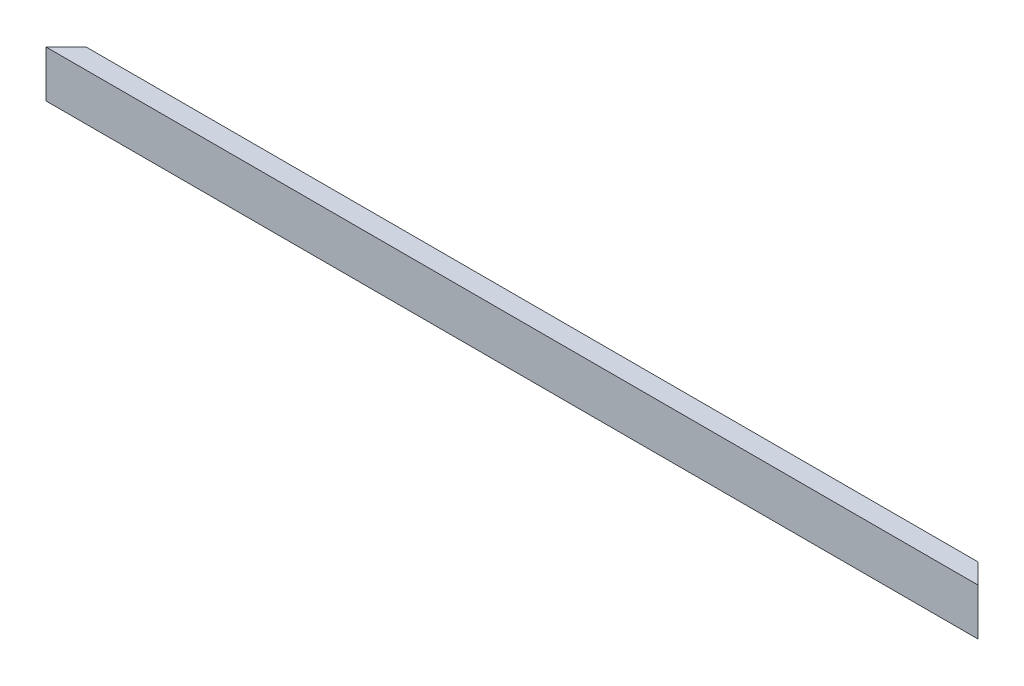
ISO-10303-21;
HEADER;
FILE_DESCRIPTION(('STEP AP214'),'2;1');
FILE_NAME('part.step','',(''),(''),'','','');
FILE_SCHEMA(('AUTOMOTIVE_DESIGN { 1 0 10303 214 1 1 1 1 }'));
ENDSEC;
DATA;
#1=APPLICATION_CONTEXT('core data for automotive mechanical design processes');
#2=APPLICATION_PROTOCOL_DEFINITION('international standard','automotive_design',2000,#1);
#3=PRODUCT_CONTEXT('',#1,'mechanical');
#4=PRODUCT('Part','Part','',(#3));
#5=PRODUCT_RELATED_PRODUCT_CATEGORY('part','',(#4));
#6=PRODUCT_DEFINITION_FORMATION('','',#4);
#7=PRODUCT_DEFINITION_CONTEXT('part definition',#1,'design');
#8=PRODUCT_DEFINITION('design','',#6,#7);
#9=PRODUCT_DEFINITION_SHAPE('','',#8);
#10=(LENGTH_UNIT() NAMED_UNIT(*) SI_UNIT(.MILLI.,.METRE.));
#11=(NAMED_UNIT(*) PLANE_ANGLE_UNIT() SI_UNIT($,.RADIAN.));
#12=(NAMED_UNIT(*) SI_UNIT($,.STERADIAN.) SOLID_ANGLE_UNIT());
#13=UNCERTAINTY_MEASURE_WITH_UNIT(LENGTH_MEASURE(1.E-05),#10,'distance_accuracy_value','');
#14=(GEOMETRIC_REPRESENTATION_CONTEXT(3) GLOBAL_UNCERTAINTY_ASSIGNED_CONTEXT((#13)) GLOBAL_UNIT_ASSIGNED_CONTEXT((#10,
#11,#12)) REPRESENTATION_CONTEXT('',''));
#15=CARTESIAN_POINT('',(0.,0.,0.));
#16=DIRECTION('',(0.,0.,1.));
#17=DIRECTION('',(1.,0.,0.));
#18=AXIS2_PLACEMENT_3D('',#15,#16,#17);
#19=CARTESIAN_POINT('',(0.,88.9,-38.1));
#20=DIRECTION('',(0.,0.,1.));
#21=DIRECTION('',(1.,0.,0.));
#22=AXIS2_PLACEMENT_3D('',#19,#20,#21);
#23=PLANE('',#22);
#24=DIRECTION('',(0.,-1.,0.));
#25=VECTOR('',#24,1.);
#26=CARTESIAN_POINT('',(38.0999999999994,88.9,-38.1));
#27=LINE('',#26,#25);
#28=CARTESIAN_POINT('',(38.0999999999994,88.9,-38.1));
#29=VERTEX_POINT('',#28);
#30=CARTESIAN_POINT('',(38.0999999999993,0.,-38.1));
#31=VERTEX_POINT('',#30);
#32=EDGE_CURVE('E54',#29,#31,#27,.T.);
#33=ORIENTED_EDGE('',*,*,#32,.F.);
#34=DIRECTION('',(-1.,0.,0.));
#35=VECTOR('',#34,1.);
#36=CARTESIAN_POINT('',(0.,88.9,-38.1));
#37=LINE('',#36,#35);
#38=CARTESIAN_POINT('',(1733.55,88.9,-38.1));
#39=VERTEX_POINT('',#38);
#40=EDGE_CURVE('E91',#39,#29,#37,.T.);
#41=ORIENTED_EDGE('',*,*,#40,.F.);
#42=DIRECTION('',(0.,-1.,0.));
#43=VECTOR('',#42,1.);
#44=CARTESIAN_POINT('',(1733.55,88.9,-38.1));
#45=LINE('',#44,#43);
#46=CARTESIAN_POINT('',(1733.55,0.,-38.1));
#47=VERTEX_POINT('',#46);
#48=EDGE_CURVE('E106',#39,#47,#45,.T.);
#49=ORIENTED_EDGE('',*,*,#48,.T.);
#50=DIRECTION('',(-1.,0.,0.));
#51=VECTOR('',#50,1.);
#52=CARTESIAN_POINT('',(0.,0.,-38.1));
#53=LINE('',#52,#51);
#54=EDGE_CURVE('E93',#47,#31,#53,.T.);
#55=ORIENTED_EDGE('',*,*,#54,.T.);
#56=EDGE_LOOP('',(#33,#41,#49,#55));
#57=FACE_BOUND('',#56,.T.);
#58=ADVANCED_FACE('F39',(#57),#23,.F.);
#59=CARTESIAN_POINT('',(0.,88.9,0.));
#60=DIRECTION('',(0.,-1.,0.));
#61=DIRECTION('',(0.,0.,-1.));
#62=AXIS2_PLACEMENT_3D('',#59,#60,#61);
#63=PLANE('',#62);
#64=DIRECTION('',(0.707106781186541,0.,-0.707106781186553));
#65=VECTOR('',#64,1.);
#66=CARTESIAN_POINT('',(0.,88.9,0.));
#67=LINE('',#66,#65);
#68=CARTESIAN_POINT('',(0.,88.9,0.));
#69=VERTEX_POINT('',#68);
#70=EDGE_CURVE('E78',#69,#29,#67,.T.);
#71=ORIENTED_EDGE('',*,*,#70,.F.);
#72=DIRECTION('',(1.,0.,0.));
#73=VECTOR('',#72,1.);
#74=CARTESIAN_POINT('',(0.,88.9,0.));
#75=LINE('',#74,#73);
#76=CARTESIAN_POINT('',(1771.65,88.9,0.));
#77=VERTEX_POINT('',#76);
#78=EDGE_CURVE('E89',#69,#77,#75,.T.);
#79=ORIENTED_EDGE('',*,*,#78,.T.);
#80=DIRECTION('',(0.707106781186544,0.,0.707106781186551));
#81=VECTOR('',#80,1.);
#82=CARTESIAN_POINT('',(1771.65,88.9,0.));
#83=LINE('',#82,#81);
#84=EDGE_CURVE('E100',#39,#77,#83,.T.);
#85=ORIENTED_EDGE('',*,*,#84,.F.);
#86=ORIENTED_EDGE('',*,*,#40,.T.);
#87=EDGE_LOOP('',(#71,#79,#85,#86));
#88=FACE_BOUND('',#87,.T.);
#89=ADVANCED_FACE('F87',(#88),#63,.F.);
#90=CARTESIAN_POINT('',(0.,0.,0.));
#91=DIRECTION('',(0.,-1.,0.));
#92=DIRECTION('',(0.,0.,-1.));
#93=AXIS2_PLACEMENT_3D('',#90,#91,#92);
#94=PLANE('',#93);
#95=DIRECTION('',(1.,0.,0.));
#96=VECTOR('',#95,1.);
#97=CARTESIAN_POINT('',(0.,0.,0.));
#98=LINE('',#97,#96);
#99=CARTESIAN_POINT('',(0.,0.,0.));
#100=VERTEX_POINT('',#99);
#101=CARTESIAN_POINT('',(1771.65,0.,0.));
#102=VERTEX_POINT('',#101);
#103=EDGE_CURVE('E97',#100,#102,#98,.T.);
#104=ORIENTED_EDGE('',*,*,#103,.F.);
#105=DIRECTION('',(0.707106781186541,0.,-0.707106781186553));
#106=VECTOR('',#105,1.);
#107=CARTESIAN_POINT('',(0.,0.,0.));
#108=LINE('',#107,#106);
#109=EDGE_CURVE('E79',#100,#31,#108,.T.);
#110=ORIENTED_EDGE('',*,*,#109,.T.);
#111=ORIENTED_EDGE('',*,*,#54,.F.);
#112=DIRECTION('',(0.707106781186544,0.,0.707106781186551));
#113=VECTOR('',#112,1.);
#114=CARTESIAN_POINT('',(1771.65,0.,0.));
#115=LINE('',#114,#113);
#116=EDGE_CURVE('E108',#47,#102,#115,.T.);
#117=ORIENTED_EDGE('',*,*,#116,.T.);
#118=EDGE_LOOP('',(#104,#110,#111,#117));
#119=FACE_BOUND('',#118,.T.);
#120=ADVANCED_FACE('F113',(#119),#94,.T.);
#121=CARTESIAN_POINT('',(0.,88.9,0.));
#122=DIRECTION('',(0.,0.,-1.));
#123=DIRECTION('',(-1.,0.,0.));
#124=AXIS2_PLACEMENT_3D('',#121,#122,#123);
#125=PLANE('',#124);
#126=ORIENTED_EDGE('',*,*,#103,.T.);
#127=DIRECTION('',(0.,-1.,0.));
#128=VECTOR('',#127,1.);
#129=CARTESIAN_POINT('',(1771.65,88.9,0.));
#130=LINE('',#129,#128);
#131=EDGE_CURVE('E47',#77,#102,#130,.T.);
#132=ORIENTED_EDGE('',*,*,#131,.F.);
#133=ORIENTED_EDGE('',*,*,#78,.F.);
#134=DIRECTION('',(0.,-1.,0.));
#135=VECTOR('',#134,1.);
#136=CARTESIAN_POINT('',(0.,88.9,0.));
#137=LINE('',#136,#135);
#138=EDGE_CURVE('E11',#69,#100,#137,.T.);
#139=ORIENTED_EDGE('',*,*,#138,.T.);
#140=EDGE_LOOP('',(#126,#132,#133,#139));
#141=FACE_BOUND('',#140,.T.);
#142=ADVANCED_FACE('F41',(#141),#125,.F.);
#143=CARTESIAN_POINT('',(1771.65,88.9,0.));
#144=DIRECTION('',(0.707106781186551,0.,-0.707106781186544));
#145=DIRECTION('',(-0.707106781186544,0.,-0.707106781186551));
#146=AXIS2_PLACEMENT_3D('',#143,#144,#145);
#147=PLANE('',#146);
#148=ORIENTED_EDGE('',*,*,#116,.F.);
#149=ORIENTED_EDGE('',*,*,#48,.F.);
#150=ORIENTED_EDGE('',*,*,#84,.T.);
#151=ORIENTED_EDGE('',*,*,#131,.T.);
#152=EDGE_LOOP('',(#148,#149,#150,#151));
#153=FACE_BOUND('',#152,.T.);
#154=ADVANCED_FACE('F111',(#153),#147,.T.);
#155=CARTESIAN_POINT('',(0.,88.9,0.));
#156=DIRECTION('',(-0.707106781186554,0.,-0.707106781186541));
#157=DIRECTION('',(-0.707106781186541,0.,0.707106781186554));
#158=AXIS2_PLACEMENT_3D('',#155,#156,#157);
#159=PLANE('',#158);
#160=ORIENTED_EDGE('',*,*,#109,.F.);
#161=ORIENTED_EDGE('',*,*,#138,.F.);
#162=ORIENTED_EDGE('',*,*,#70,.T.);
#163=ORIENTED_EDGE('',*,*,#32,.T.);
#164=EDGE_LOOP('',(#160,#161,#162,#163));
#165=FACE_BOUND('',#164,.T.);
#166=ADVANCED_FACE('F77',(#165),#159,.T.);
#167=CLOSED_SHELL('',(#58,#89,#120,#142,#154,#166));
#168=MANIFOLD_SOLID_BREP('B2',#167);
#169=ADVANCED_BREP_SHAPE_REPRESENTATION('',(#18,#168),#14);
#170=SHAPE_DEFINITION_REPRESENTATION(#9,#169);
ENDSEC;
END-ISO-10303-21;
